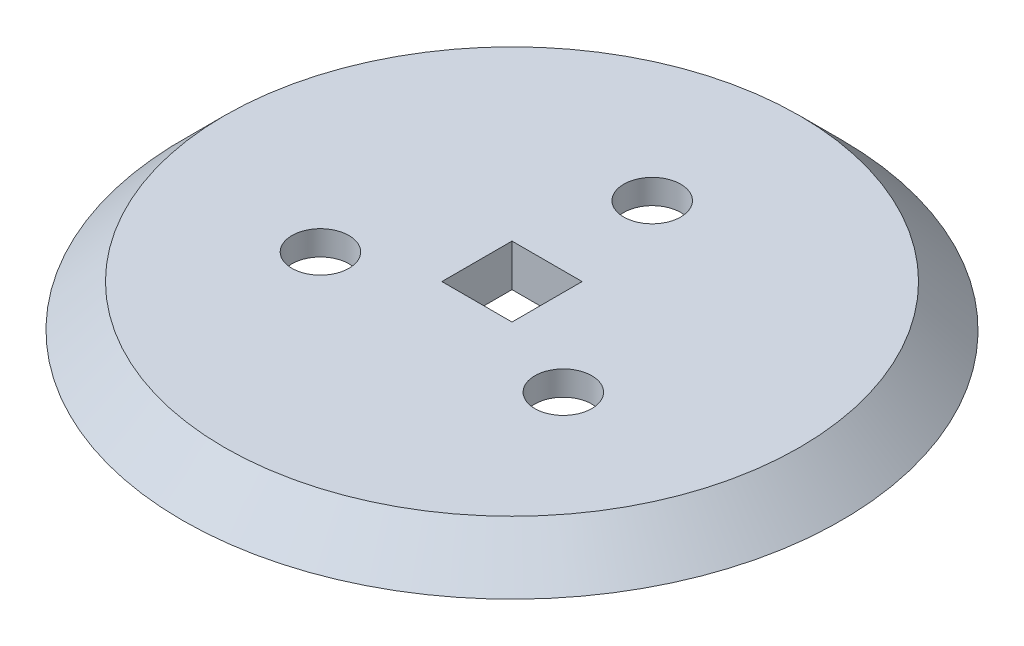
ISO-10303-21;
HEADER;
FILE_DESCRIPTION(('STEP AP214'),'2;1');
FILE_NAME('part.step','',(''),(''),'','','');
FILE_SCHEMA(('AUTOMOTIVE_DESIGN { 1 0 10303 214 1 1 1 1 }'));
ENDSEC;
DATA;
#1=APPLICATION_CONTEXT('core data for automotive mechanical design processes');
#2=APPLICATION_PROTOCOL_DEFINITION('international standard','automotive_design',2000,#1);
#3=PRODUCT_CONTEXT('',#1,'mechanical');
#4=PRODUCT('Part','Part','',(#3));
#5=PRODUCT_RELATED_PRODUCT_CATEGORY('part','',(#4));
#6=PRODUCT_DEFINITION_FORMATION('','',#4);
#7=PRODUCT_DEFINITION_CONTEXT('part definition',#1,'design');
#8=PRODUCT_DEFINITION('design','',#6,#7);
#9=PRODUCT_DEFINITION_SHAPE('','',#8);
#10=(LENGTH_UNIT() NAMED_UNIT(*) SI_UNIT(.MILLI.,.METRE.));
#11=(NAMED_UNIT(*) PLANE_ANGLE_UNIT() SI_UNIT($,.RADIAN.));
#12=(NAMED_UNIT(*) SI_UNIT($,.STERADIAN.) SOLID_ANGLE_UNIT());
#13=UNCERTAINTY_MEASURE_WITH_UNIT(LENGTH_MEASURE(1.E-05),#10,'distance_accuracy_value','');
#14=(GEOMETRIC_REPRESENTATION_CONTEXT(3) GLOBAL_UNCERTAINTY_ASSIGNED_CONTEXT((#13)) GLOBAL_UNIT_ASSIGNED_CONTEXT((#10,
#11,#12)) REPRESENTATION_CONTEXT('',''));
#15=CARTESIAN_POINT('',(0.,0.,0.));
#16=DIRECTION('',(0.,0.,1.));
#17=DIRECTION('',(1.,0.,0.));
#18=AXIS2_PLACEMENT_3D('',#15,#16,#17);
#19=CARTESIAN_POINT('',(0.,3.81,-12.7));
#20=DIRECTION('',(0.,-1.,0.));
#21=DIRECTION('',(0.,0.,-1.));
#22=AXIS2_PLACEMENT_3D('',#19,#20,#21);
#23=CYLINDRICAL_SURFACE('',#22,2.5796875);
#24=CARTESIAN_POINT('',(0.,3.81,-12.7));
#25=DIRECTION('',(0.,1.,0.));
#26=DIRECTION('',(0.,0.,1.));
#27=AXIS2_PLACEMENT_3D('',#24,#25,#26);
#28=CIRCLE('',#27,2.5796875);
#29=CARTESIAN_POINT('',(0.,3.81,-15.2796875));
#30=VERTEX_POINT('',#29);
#31=EDGE_CURVE('E105',#30,#30,#28,.T.);
#32=CARTESIAN_POINT('',(0.,1.5875,-12.7));
#33=DIRECTION('',(0.,-1.,0.));
#34=DIRECTION('',(0.,0.,-1.));
#35=AXIS2_PLACEMENT_3D('',#32,#33,#34);
#36=CIRCLE('',#35,2.5796875);
#37=CARTESIAN_POINT('',(0.,1.5875,-15.2796875));
#38=VERTEX_POINT('',#37);
#39=EDGE_CURVE('E37',#38,#38,#36,.T.);
#40=CARTESIAN_POINT('',(0.,3.81,-15.2796875));
#41=CARTESIAN_POINT('',(0.,3.78684895833333,-15.2796875));
#42=CARTESIAN_POINT('',(0.,3.76369791666667,-15.2796875));
#43=CARTESIAN_POINT('',(0.,3.71739583333333,-15.2796875));
#44=CARTESIAN_POINT('',(0.,3.69424479166667,-15.2796875));
#45=CARTESIAN_POINT('',(0.,3.64794270833333,-15.2796875));
#46=CARTESIAN_POINT('',(0.,3.62479166666667,-15.2796875));
#47=CARTESIAN_POINT('',(0.,3.57848958333333,-15.2796875));
#48=CARTESIAN_POINT('',(0.,3.55533854166667,-15.2796875));
#49=CARTESIAN_POINT('',(0.,3.50903645833333,-15.2796875));
#50=CARTESIAN_POINT('',(0.,3.48588541666667,-15.2796875));
#51=CARTESIAN_POINT('',(0.,3.43958333333333,-15.2796875));
#52=CARTESIAN_POINT('',(0.,3.41643229166667,-15.2796875));
#53=CARTESIAN_POINT('',(0.,3.37013020833333,-15.2796875));
#54=CARTESIAN_POINT('',(0.,3.34697916666667,-15.2796875));
#55=CARTESIAN_POINT('',(0.,3.30067708333333,-15.2796875));
#56=CARTESIAN_POINT('',(0.,3.27752604166667,-15.2796875));
#57=CARTESIAN_POINT('',(0.,3.23122395833333,-15.2796875));
#58=CARTESIAN_POINT('',(0.,3.20807291666667,-15.2796875));
#59=CARTESIAN_POINT('',(0.,3.16177083333333,-15.2796875));
#60=CARTESIAN_POINT('',(0.,3.13861979166667,-15.2796875));
#61=CARTESIAN_POINT('',(0.,3.09231770833333,-15.2796875));
#62=CARTESIAN_POINT('',(0.,3.06916666666667,-15.2796875));
#63=CARTESIAN_POINT('',(0.,3.02286458333333,-15.2796875));
#64=CARTESIAN_POINT('',(0.,2.99971354166667,-15.2796875));
#65=CARTESIAN_POINT('',(0.,2.95341145833333,-15.2796875));
#66=CARTESIAN_POINT('',(0.,2.93026041666667,-15.2796875));
#67=CARTESIAN_POINT('',(0.,2.88395833333333,-15.2796875));
#68=CARTESIAN_POINT('',(0.,2.86080729166667,-15.2796875));
#69=CARTESIAN_POINT('',(0.,2.81450520833333,-15.2796875));
#70=CARTESIAN_POINT('',(0.,2.79135416666667,-15.2796875));
#71=CARTESIAN_POINT('',(0.,2.74505208333333,-15.2796875));
#72=CARTESIAN_POINT('',(0.,2.72190104166667,-15.2796875));
#73=CARTESIAN_POINT('',(0.,2.67559895833333,-15.2796875));
#74=CARTESIAN_POINT('',(0.,2.65244791666667,-15.2796875));
#75=CARTESIAN_POINT('',(0.,2.60614583333333,-15.2796875));
#76=CARTESIAN_POINT('',(0.,2.58299479166667,-15.2796875));
#77=CARTESIAN_POINT('',(0.,2.53669270833333,-15.2796875));
#78=CARTESIAN_POINT('',(0.,2.51354166666667,-15.2796875));
#79=CARTESIAN_POINT('',(0.,2.46723958333333,-15.2796875));
#80=CARTESIAN_POINT('',(0.,2.44408854166667,-15.2796875));
#81=CARTESIAN_POINT('',(0.,2.39778645833333,-15.2796875));
#82=CARTESIAN_POINT('',(0.,2.37463541666667,-15.2796875));
#83=CARTESIAN_POINT('',(0.,2.32833333333333,-15.2796875));
#84=CARTESIAN_POINT('',(0.,2.30518229166667,-15.2796875));
#85=CARTESIAN_POINT('',(0.,2.25888020833333,-15.2796875));
#86=CARTESIAN_POINT('',(0.,2.23572916666667,-15.2796875));
#87=CARTESIAN_POINT('',(0.,2.18942708333333,-15.2796875));
#88=CARTESIAN_POINT('',(0.,2.16627604166667,-15.2796875));
#89=CARTESIAN_POINT('',(0.,2.11997395833333,-15.2796875));
#90=CARTESIAN_POINT('',(0.,2.09682291666667,-15.2796875));
#91=CARTESIAN_POINT('',(0.,2.05052083333333,-15.2796875));
#92=CARTESIAN_POINT('',(0.,2.02736979166667,-15.2796875));
#93=CARTESIAN_POINT('',(0.,1.98106770833333,-15.2796875));
#94=CARTESIAN_POINT('',(0.,1.95791666666667,-15.2796875));
#95=CARTESIAN_POINT('',(0.,1.91161458333333,-15.2796875));
#96=CARTESIAN_POINT('',(0.,1.88846354166667,-15.2796875));
#97=CARTESIAN_POINT('',(0.,1.84216145833333,-15.2796875));
#98=CARTESIAN_POINT('',(0.,1.81901041666667,-15.2796875));
#99=CARTESIAN_POINT('',(0.,1.77270833333333,-15.2796875));
#100=CARTESIAN_POINT('',(0.,1.74955729166667,-15.2796875));
#101=CARTESIAN_POINT('',(0.,1.70325520833333,-15.2796875));
#102=CARTESIAN_POINT('',(0.,1.68010416666667,-15.2796875));
#103=CARTESIAN_POINT('',(0.,1.63380208333333,-15.2796875));
#104=CARTESIAN_POINT('',(0.,1.61065104166667,-15.2796875));
#105=CARTESIAN_POINT('',(0.,1.5875,-15.2796875));
#106=B_SPLINE_CURVE_WITH_KNOTS('',3,(#40,#41,#42,#43,#44,#45,#46,#47,#48,#49,#50,#51,#52,#53,
#54,#55,#56,#57,#58,#59,#60,#61,#62,#63,#64,#65,#66,#67,#68,#69,#70,#71,#72,#73,#74,#75,#76,#77,
#78,#79,#80,#81,#82,#83,#84,#85,#86,#87,#88,#89,#90,#91,#92,#93,#94,#95,#96,#97,#98,#99,#100,
#101,#102,#103,#104,#105),.UNSPECIFIED.,.F.,.F.,(4,2,2,2,2,2,2,2,2,2,2,2,2,2,2,2,2,2,2,2,2,2,2,
2,2,2,2,2,2,2,2,2,4),(0.,0.0694531249999996,0.13890625,0.208359375,0.277812499999999,
0.347265624999999,0.41671875,0.486171875,0.555625,0.625078124999999,0.694531249999999,
0.763984374999999,0.833437499999999,0.902890625,0.972343749999999,1.041796875,1.11125,
1.180703125,1.25015625,1.319609375,1.3890625,1.458515625,1.52796875,1.597421875,1.666875,
1.736328125,1.80578125,1.875234375,1.9446875,2.014140625,2.08359375,2.153046875,2.2225),.UNSPECIFIED.);
#107=EDGE_CURVE('BSEAM33',#30,#38,#106,.T.);
#108=ORIENTED_EDGE('',*,*,#31,.T.);
#109=ORIENTED_EDGE('',*,*,#39,.T.);
#110=ORIENTED_EDGE('',*,*,#107,.T.);
#111=ORIENTED_EDGE('',*,*,#107,.F.);
#112=EDGE_LOOP('',(#108,#110,#109,#111));
#113=FACE_BOUND('',#112,.T.);
#114=ADVANCED_FACE('F33',(#113),#23,.F.);
#115=CARTESIAN_POINT('',(10.9985226280623,3.81,6.35000000000005));
#116=DIRECTION('',(0.,-1.,0.));
#117=DIRECTION('',(0.,0.,-1.));
#118=AXIS2_PLACEMENT_3D('',#115,#116,#117);
#119=CYLINDRICAL_SURFACE('',#118,2.5796875);
#120=CARTESIAN_POINT('',(10.9985226280623,3.81,6.35000000000005));
#121=DIRECTION('',(0.,1.,0.));
#122=DIRECTION('',(0.,0.,1.));
#123=AXIS2_PLACEMENT_3D('',#120,#121,#122);
#124=CIRCLE('',#123,2.5796875);
#125=CARTESIAN_POINT('',(10.9985226280623,3.81,3.77031250000005));
#126=VERTEX_POINT('',#125);
#127=EDGE_CURVE('E129',#126,#126,#124,.T.);
#128=CARTESIAN_POINT('',(10.9985226280623,1.5875,6.35000000000005));
#129=DIRECTION('',(0.,-1.,0.));
#130=DIRECTION('',(0.,0.,-1.));
#131=AXIS2_PLACEMENT_3D('',#128,#129,#130);
#132=CIRCLE('',#131,2.5796875);
#133=CARTESIAN_POINT('',(10.9985226280623,1.5875,3.77031250000005));
#134=VERTEX_POINT('',#133);
#135=EDGE_CURVE('E119',#134,#134,#132,.T.);
#136=CARTESIAN_POINT('',(10.9985226280623,3.81,3.77031250000005));
#137=CARTESIAN_POINT('',(10.9985226280623,3.78684895833333,3.77031250000005));
#138=CARTESIAN_POINT('',(10.9985226280623,3.76369791666667,3.77031250000005));
#139=CARTESIAN_POINT('',(10.9985226280623,3.71739583333333,3.77031250000005));
#140=CARTESIAN_POINT('',(10.9985226280623,3.69424479166667,3.77031250000005));
#141=CARTESIAN_POINT('',(10.9985226280623,3.64794270833333,3.77031250000005));
#142=CARTESIAN_POINT('',(10.9985226280623,3.62479166666667,3.77031250000005));
#143=CARTESIAN_POINT('',(10.9985226280623,3.57848958333333,3.77031250000005));
#144=CARTESIAN_POINT('',(10.9985226280623,3.55533854166667,3.77031250000005));
#145=CARTESIAN_POINT('',(10.9985226280623,3.50903645833333,3.77031250000005));
#146=CARTESIAN_POINT('',(10.9985226280623,3.48588541666667,3.77031250000005));
#147=CARTESIAN_POINT('',(10.9985226280623,3.43958333333333,3.77031250000005));
#148=CARTESIAN_POINT('',(10.9985226280623,3.41643229166667,3.77031250000005));
#149=CARTESIAN_POINT('',(10.9985226280623,3.37013020833333,3.77031250000005));
#150=CARTESIAN_POINT('',(10.9985226280623,3.34697916666667,3.77031250000005));
#151=CARTESIAN_POINT('',(10.9985226280623,3.30067708333333,3.77031250000005));
#152=CARTESIAN_POINT('',(10.9985226280623,3.27752604166667,3.77031250000005));
#153=CARTESIAN_POINT('',(10.9985226280623,3.23122395833333,3.77031250000005));
#154=CARTESIAN_POINT('',(10.9985226280623,3.20807291666667,3.77031250000005));
#155=CARTESIAN_POINT('',(10.9985226280623,3.16177083333333,3.77031250000005));
#156=CARTESIAN_POINT('',(10.9985226280623,3.13861979166667,3.77031250000005));
#157=CARTESIAN_POINT('',(10.9985226280623,3.09231770833333,3.77031250000005));
#158=CARTESIAN_POINT('',(10.9985226280623,3.06916666666667,3.77031250000005));
#159=CARTESIAN_POINT('',(10.9985226280623,3.02286458333333,3.77031250000005));
#160=CARTESIAN_POINT('',(10.9985226280623,2.99971354166667,3.77031250000005));
#161=CARTESIAN_POINT('',(10.9985226280623,2.95341145833333,3.77031250000005));
#162=CARTESIAN_POINT('',(10.9985226280623,2.93026041666667,3.77031250000005));
#163=CARTESIAN_POINT('',(10.9985226280623,2.88395833333333,3.77031250000005));
#164=CARTESIAN_POINT('',(10.9985226280623,2.86080729166667,3.77031250000005));
#165=CARTESIAN_POINT('',(10.9985226280623,2.81450520833333,3.77031250000005));
#166=CARTESIAN_POINT('',(10.9985226280623,2.79135416666667,3.77031250000005));
#167=CARTESIAN_POINT('',(10.9985226280623,2.74505208333333,3.77031250000005));
#168=CARTESIAN_POINT('',(10.9985226280623,2.72190104166667,3.77031250000005));
#169=CARTESIAN_POINT('',(10.9985226280623,2.67559895833333,3.77031250000005));
#170=CARTESIAN_POINT('',(10.9985226280623,2.65244791666667,3.77031250000005));
#171=CARTESIAN_POINT('',(10.9985226280623,2.60614583333333,3.77031250000005));
#172=CARTESIAN_POINT('',(10.9985226280623,2.58299479166667,3.77031250000005));
#173=CARTESIAN_POINT('',(10.9985226280623,2.53669270833333,3.77031250000005));
#174=CARTESIAN_POINT('',(10.9985226280623,2.51354166666667,3.77031250000005));
#175=CARTESIAN_POINT('',(10.9985226280623,2.46723958333333,3.77031250000005));
#176=CARTESIAN_POINT('',(10.9985226280623,2.44408854166667,3.77031250000005));
#177=CARTESIAN_POINT('',(10.9985226280623,2.39778645833333,3.77031250000005));
#178=CARTESIAN_POINT('',(10.9985226280623,2.37463541666667,3.77031250000005));
#179=CARTESIAN_POINT('',(10.9985226280623,2.32833333333333,3.77031250000005));
#180=CARTESIAN_POINT('',(10.9985226280623,2.30518229166667,3.77031250000005));
#181=CARTESIAN_POINT('',(10.9985226280623,2.25888020833333,3.77031250000005));
#182=CARTESIAN_POINT('',(10.9985226280623,2.23572916666667,3.77031250000005));
#183=CARTESIAN_POINT('',(10.9985226280623,2.18942708333333,3.77031250000005));
#184=CARTESIAN_POINT('',(10.9985226280623,2.16627604166667,3.77031250000005));
#185=CARTESIAN_POINT('',(10.9985226280623,2.11997395833333,3.77031250000005));
#186=CARTESIAN_POINT('',(10.9985226280623,2.09682291666667,3.77031250000005));
#187=CARTESIAN_POINT('',(10.9985226280623,2.05052083333333,3.77031250000005));
#188=CARTESIAN_POINT('',(10.9985226280623,2.02736979166667,3.77031250000005));
#189=CARTESIAN_POINT('',(10.9985226280623,1.98106770833333,3.77031250000005));
#190=CARTESIAN_POINT('',(10.9985226280623,1.95791666666667,3.77031250000005));
#191=CARTESIAN_POINT('',(10.9985226280623,1.91161458333333,3.77031250000005));
#192=CARTESIAN_POINT('',(10.9985226280623,1.88846354166667,3.77031250000005));
#193=CARTESIAN_POINT('',(10.9985226280623,1.84216145833333,3.77031250000005));
#194=CARTESIAN_POINT('',(10.9985226280623,1.81901041666667,3.77031250000005));
#195=CARTESIAN_POINT('',(10.9985226280623,1.77270833333333,3.77031250000005));
#196=CARTESIAN_POINT('',(10.9985226280623,1.74955729166667,3.77031250000005));
#197=CARTESIAN_POINT('',(10.9985226280623,1.70325520833333,3.77031250000005));
#198=CARTESIAN_POINT('',(10.9985226280623,1.68010416666667,3.77031250000005));
#199=CARTESIAN_POINT('',(10.9985226280623,1.63380208333333,3.77031250000005));
#200=CARTESIAN_POINT('',(10.9985226280623,1.61065104166667,3.77031250000005));
#201=CARTESIAN_POINT('',(10.9985226280623,1.5875,3.77031250000005));
#202=B_SPLINE_CURVE_WITH_KNOTS('',3,(#136,#137,#138,#139,#140,#141,#142,#143,#144,#145,#146,
#147,#148,#149,#150,#151,#152,#153,#154,#155,#156,#157,#158,#159,#160,#161,#162,#163,#164,#165,
#166,#167,#168,#169,#170,#171,#172,#173,#174,#175,#176,#177,#178,#179,#180,#181,#182,#183,#184,
#185,#186,#187,#188,#189,#190,#191,#192,#193,#194,#195,#196,#197,#198,#199,#200,#201),
.UNSPECIFIED.,.F.,.F.,(4,2,2,2,2,2,2,2,2,2,2,2,2,2,2,2,2,2,2,2,2,2,2,2,2,2,2,2,2,2,2,2,4),(0.,
0.0694531249999996,0.13890625,0.208359375,0.277812499999999,0.347265624999999,0.41671875,
0.486171875,0.555625,0.625078124999999,0.694531249999999,0.763984374999999,0.833437499999999,
0.902890625,0.972343749999999,1.041796875,1.11125,1.180703125,1.25015625,1.319609375,1.3890625,
1.458515625,1.52796875,1.597421875,1.666875,1.736328125,1.80578125,1.875234375,1.9446875,
2.014140625,2.08359375,2.153046875,2.2225),.UNSPECIFIED.);
#203=EDGE_CURVE('BSEAM152',#126,#134,#202,.T.);
#204=ORIENTED_EDGE('',*,*,#127,.T.);
#205=ORIENTED_EDGE('',*,*,#135,.T.);
#206=ORIENTED_EDGE('',*,*,#203,.T.);
#207=ORIENTED_EDGE('',*,*,#203,.F.);
#208=EDGE_LOOP('',(#204,#206,#205,#207));
#209=FACE_BOUND('',#208,.T.);
#210=ADVANCED_FACE('F152',(#209),#119,.F.);
#211=CARTESIAN_POINT('',(-10.9985226280624,3.81,6.3499999999999));
#212=DIRECTION('',(0.,-1.,0.));
#213=DIRECTION('',(0.,0.,-1.));
#214=AXIS2_PLACEMENT_3D('',#211,#212,#213);
#215=CYLINDRICAL_SURFACE('',#214,2.5796875);
#216=CARTESIAN_POINT('',(-10.9985226280624,3.81,6.3499999999999));
#217=DIRECTION('',(0.,1.,0.));
#218=DIRECTION('',(0.,0.,1.));
#219=AXIS2_PLACEMENT_3D('',#216,#217,#218);
#220=CIRCLE('',#219,2.5796875);
#221=CARTESIAN_POINT('',(-10.9985226280624,3.81,3.7703124999999));
#222=VERTEX_POINT('',#221);
#223=EDGE_CURVE('E125',#222,#222,#220,.T.);
#224=CARTESIAN_POINT('',(-10.9985226280624,1.5875,6.3499999999999));
#225=DIRECTION('',(0.,-1.,0.));
#226=DIRECTION('',(0.,0.,-1.));
#227=AXIS2_PLACEMENT_3D('',#224,#225,#226);
#228=CIRCLE('',#227,2.5796875);
#229=CARTESIAN_POINT('',(-10.9985226280624,1.5875,3.7703124999999));
#230=VERTEX_POINT('',#229);
#231=EDGE_CURVE('E117',#230,#230,#228,.T.);
#232=CARTESIAN_POINT('',(-10.9985226280624,3.81,3.7703124999999));
#233=CARTESIAN_POINT('',(-10.9985226280624,3.78684895833333,3.7703124999999));
#234=CARTESIAN_POINT('',(-10.9985226280624,3.76369791666667,3.7703124999999));
#235=CARTESIAN_POINT('',(-10.9985226280624,3.71739583333333,3.7703124999999));
#236=CARTESIAN_POINT('',(-10.9985226280624,3.69424479166667,3.7703124999999));
#237=CARTESIAN_POINT('',(-10.9985226280624,3.64794270833333,3.7703124999999));
#238=CARTESIAN_POINT('',(-10.9985226280624,3.62479166666667,3.7703124999999));
#239=CARTESIAN_POINT('',(-10.9985226280624,3.57848958333333,3.7703124999999));
#240=CARTESIAN_POINT('',(-10.9985226280624,3.55533854166667,3.7703124999999));
#241=CARTESIAN_POINT('',(-10.9985226280624,3.50903645833333,3.7703124999999));
#242=CARTESIAN_POINT('',(-10.9985226280624,3.48588541666667,3.7703124999999));
#243=CARTESIAN_POINT('',(-10.9985226280624,3.43958333333333,3.7703124999999));
#244=CARTESIAN_POINT('',(-10.9985226280624,3.41643229166667,3.7703124999999));
#245=CARTESIAN_POINT('',(-10.9985226280624,3.37013020833333,3.7703124999999));
#246=CARTESIAN_POINT('',(-10.9985226280624,3.34697916666667,3.7703124999999));
#247=CARTESIAN_POINT('',(-10.9985226280624,3.30067708333333,3.7703124999999));
#248=CARTESIAN_POINT('',(-10.9985226280624,3.27752604166667,3.7703124999999));
#249=CARTESIAN_POINT('',(-10.9985226280624,3.23122395833333,3.7703124999999));
#250=CARTESIAN_POINT('',(-10.9985226280624,3.20807291666667,3.7703124999999));
#251=CARTESIAN_POINT('',(-10.9985226280624,3.16177083333333,3.7703124999999));
#252=CARTESIAN_POINT('',(-10.9985226280624,3.13861979166667,3.7703124999999));
#253=CARTESIAN_POINT('',(-10.9985226280624,3.09231770833333,3.7703124999999));
#254=CARTESIAN_POINT('',(-10.9985226280624,3.06916666666667,3.7703124999999));
#255=CARTESIAN_POINT('',(-10.9985226280624,3.02286458333333,3.7703124999999));
#256=CARTESIAN_POINT('',(-10.9985226280624,2.99971354166667,3.7703124999999));
#257=CARTESIAN_POINT('',(-10.9985226280624,2.95341145833333,3.7703124999999));
#258=CARTESIAN_POINT('',(-10.9985226280624,2.93026041666667,3.7703124999999));
#259=CARTESIAN_POINT('',(-10.9985226280624,2.88395833333333,3.7703124999999));
#260=CARTESIAN_POINT('',(-10.9985226280624,2.86080729166667,3.7703124999999));
#261=CARTESIAN_POINT('',(-10.9985226280624,2.81450520833333,3.7703124999999));
#262=CARTESIAN_POINT('',(-10.9985226280624,2.79135416666667,3.7703124999999));
#263=CARTESIAN_POINT('',(-10.9985226280624,2.74505208333333,3.7703124999999));
#264=CARTESIAN_POINT('',(-10.9985226280624,2.72190104166667,3.7703124999999));
#265=CARTESIAN_POINT('',(-10.9985226280624,2.67559895833333,3.7703124999999));
#266=CARTESIAN_POINT('',(-10.9985226280624,2.65244791666667,3.7703124999999));
#267=CARTESIAN_POINT('',(-10.9985226280624,2.60614583333333,3.7703124999999));
#268=CARTESIAN_POINT('',(-10.9985226280624,2.58299479166667,3.7703124999999));
#269=CARTESIAN_POINT('',(-10.9985226280624,2.53669270833333,3.7703124999999));
#270=CARTESIAN_POINT('',(-10.9985226280624,2.51354166666667,3.7703124999999));
#271=CARTESIAN_POINT('',(-10.9985226280624,2.46723958333333,3.7703124999999));
#272=CARTESIAN_POINT('',(-10.9985226280624,2.44408854166667,3.7703124999999));
#273=CARTESIAN_POINT('',(-10.9985226280624,2.39778645833333,3.7703124999999));
#274=CARTESIAN_POINT('',(-10.9985226280624,2.37463541666667,3.7703124999999));
#275=CARTESIAN_POINT('',(-10.9985226280624,2.32833333333333,3.7703124999999));
#276=CARTESIAN_POINT('',(-10.9985226280624,2.30518229166667,3.7703124999999));
#277=CARTESIAN_POINT('',(-10.9985226280624,2.25888020833333,3.7703124999999));
#278=CARTESIAN_POINT('',(-10.9985226280624,2.23572916666667,3.7703124999999));
#279=CARTESIAN_POINT('',(-10.9985226280624,2.18942708333333,3.7703124999999));
#280=CARTESIAN_POINT('',(-10.9985226280624,2.16627604166667,3.7703124999999));
#281=CARTESIAN_POINT('',(-10.9985226280624,2.11997395833333,3.7703124999999));
#282=CARTESIAN_POINT('',(-10.9985226280624,2.09682291666667,3.7703124999999));
#283=CARTESIAN_POINT('',(-10.9985226280624,2.05052083333333,3.7703124999999));
#284=CARTESIAN_POINT('',(-10.9985226280624,2.02736979166667,3.7703124999999));
#285=CARTESIAN_POINT('',(-10.9985226280624,1.98106770833333,3.7703124999999));
#286=CARTESIAN_POINT('',(-10.9985226280624,1.95791666666667,3.7703124999999));
#287=CARTESIAN_POINT('',(-10.9985226280624,1.91161458333333,3.7703124999999));
#288=CARTESIAN_POINT('',(-10.9985226280624,1.88846354166667,3.7703124999999));
#289=CARTESIAN_POINT('',(-10.9985226280624,1.84216145833333,3.7703124999999));
#290=CARTESIAN_POINT('',(-10.9985226280624,1.81901041666667,3.7703124999999));
#291=CARTESIAN_POINT('',(-10.9985226280624,1.77270833333333,3.7703124999999));
#292=CARTESIAN_POINT('',(-10.9985226280624,1.74955729166667,3.7703124999999));
#293=CARTESIAN_POINT('',(-10.9985226280624,1.70325520833333,3.7703124999999));
#294=CARTESIAN_POINT('',(-10.9985226280624,1.68010416666667,3.7703124999999));
#295=CARTESIAN_POINT('',(-10.9985226280624,1.63380208333333,3.7703124999999));
#296=CARTESIAN_POINT('',(-10.9985226280624,1.61065104166667,3.7703124999999));
#297=CARTESIAN_POINT('',(-10.9985226280624,1.5875,3.7703124999999));
#298=B_SPLINE_CURVE_WITH_KNOTS('',3,(#232,#233,#234,#235,#236,#237,#238,#239,#240,#241,#242,
#243,#244,#245,#246,#247,#248,#249,#250,#251,#252,#253,#254,#255,#256,#257,#258,#259,#260,#261,
#262,#263,#264,#265,#266,#267,#268,#269,#270,#271,#272,#273,#274,#275,#276,#277,#278,#279,#280,
#281,#282,#283,#284,#285,#286,#287,#288,#289,#290,#291,#292,#293,#294,#295,#296,#297),
.UNSPECIFIED.,.F.,.F.,(4,2,2,2,2,2,2,2,2,2,2,2,2,2,2,2,2,2,2,2,2,2,2,2,2,2,2,2,2,2,2,2,4),(0.,
0.0694531249999996,0.13890625,0.208359375,0.277812499999999,0.347265624999999,0.41671875,
0.486171875,0.555625,0.625078124999999,0.694531249999999,0.763984374999999,0.833437499999999,
0.902890625,0.972343749999999,1.041796875,1.11125,1.180703125,1.25015625,1.319609375,1.3890625,
1.458515625,1.52796875,1.597421875,1.666875,1.736328125,1.80578125,1.875234375,1.9446875,
2.014140625,2.08359375,2.153046875,2.2225),.UNSPECIFIED.);
#299=EDGE_CURVE('BSEAM144',#222,#230,#298,.T.);
#300=ORIENTED_EDGE('',*,*,#223,.T.);
#301=ORIENTED_EDGE('',*,*,#231,.T.);
#302=ORIENTED_EDGE('',*,*,#299,.T.);
#303=ORIENTED_EDGE('',*,*,#299,.F.);
#304=EDGE_LOOP('',(#300,#302,#301,#303));
#305=FACE_BOUND('',#304,.T.);
#306=ADVANCED_FACE('F144',(#305),#215,.F.);
#307=CARTESIAN_POINT('',(0.,3.81,0.));
#308=DIRECTION('',(0.,1.,0.));
#309=DIRECTION('',(0.,0.,1.));
#310=AXIS2_PLACEMENT_3D('',#307,#308,#309);
#311=PLANE('',#310);
#312=CARTESIAN_POINT('',(0.,3.81,0.));
#313=DIRECTION('',(0.,1.,0.));
#314=DIRECTION('',(0.,0.,1.));
#315=AXIS2_PLACEMENT_3D('',#312,#313,#314);
#316=CIRCLE('',#315,26.0349999999999);
#317=CARTESIAN_POINT('',(0.,3.81,-26.0349999999999));
#318=VERTEX_POINT('',#317);
#319=EDGE_CURVE('E42',#318,#318,#316,.T.);
#320=ORIENTED_EDGE('',*,*,#319,.T.);
#321=EDGE_LOOP('',(#320));
#322=FACE_BOUND('',#321,.T.);
#323=ORIENTED_EDGE('',*,*,#127,.F.);
#324=EDGE_LOOP('',(#323));
#325=FACE_BOUND('',#324,.T.);
#326=DIRECTION('',(1.,0.,0.));
#327=VECTOR('',#326,1.);
#328=CARTESIAN_POINT('',(-3.175,3.81,3.175));
#329=LINE('',#328,#327);
#330=CARTESIAN_POINT('',(-3.175,3.81,3.175));
#331=VERTEX_POINT('',#330);
#332=CARTESIAN_POINT('',(3.175,3.81,3.175));
#333=VERTEX_POINT('',#332);
#334=EDGE_CURVE('E84',#331,#333,#329,.T.);
#335=ORIENTED_EDGE('',*,*,#334,.F.);
#336=DIRECTION('',(0.,0.,1.));
#337=VECTOR('',#336,1.);
#338=CARTESIAN_POINT('',(-3.175,3.81,-3.175));
#339=LINE('',#338,#337);
#340=CARTESIAN_POINT('',(-3.175,3.81,-3.175));
#341=VERTEX_POINT('',#340);
#342=EDGE_CURVE('E76',#341,#331,#339,.T.);
#343=ORIENTED_EDGE('',*,*,#342,.F.);
#344=DIRECTION('',(-1.,0.,0.));
#345=VECTOR('',#344,1.);
#346=CARTESIAN_POINT('',(-3.175,3.81,-3.175));
#347=LINE('',#346,#345);
#348=CARTESIAN_POINT('',(3.175,3.81,-3.175));
#349=VERTEX_POINT('',#348);
#350=EDGE_CURVE('E99',#349,#341,#347,.T.);
#351=ORIENTED_EDGE('',*,*,#350,.F.);
#352=DIRECTION('',(0.,0.,-1.));
#353=VECTOR('',#352,1.);
#354=CARTESIAN_POINT('',(3.175,3.81,-3.175));
#355=LINE('',#354,#353);
#356=EDGE_CURVE('E97',#333,#349,#355,.T.);
#357=ORIENTED_EDGE('',*,*,#356,.F.);
#358=EDGE_LOOP('',(#335,#343,#351,#357));
#359=FACE_BOUND('',#358,.T.);
#360=ORIENTED_EDGE('',*,*,#31,.F.);
#361=EDGE_LOOP('',(#360));
#362=FACE_BOUND('',#361,.T.);
#363=ORIENTED_EDGE('',*,*,#223,.F.);
#364=EDGE_LOOP('',(#363));
#365=FACE_BOUND('',#364,.T.);
#366=ADVANCED_FACE('F95',(#322,#325,#359,#362,#365),#311,.T.);
#367=CARTESIAN_POINT('',(0.,0.,0.));
#368=DIRECTION('',(0.,1.,0.));
#369=DIRECTION('',(0.,0.,1.));
#370=AXIS2_PLACEMENT_3D('',#367,#368,#369);
#371=PLANE('',#370);
#372=CARTESIAN_POINT('',(0.,0.,-12.7));
#373=DIRECTION('',(0.,-1.,0.));
#374=DIRECTION('',(0.,0.,-1.));
#375=AXIS2_PLACEMENT_3D('',#372,#373,#374);
#376=CIRCLE('',#375,5.409375008);
#377=CARTESIAN_POINT('',(0.,0.,-18.109375008));
#378=VERTEX_POINT('',#377);
#379=EDGE_CURVE('E294',#378,#378,#376,.T.);
#380=ORIENTED_EDGE('',*,*,#379,.F.);
#381=EDGE_LOOP('',(#380));
#382=FACE_BOUND('',#381,.T.);
#383=CARTESIAN_POINT('',(-10.9985226280624,0.,6.3499999999999));
#384=DIRECTION('',(0.,-1.,0.));
#385=DIRECTION('',(0.,0.,-1.));
#386=AXIS2_PLACEMENT_3D('',#383,#384,#385);
#387=CIRCLE('',#386,5.409375008);
#388=CARTESIAN_POINT('',(-10.9985226280624,0.,0.940624991999896));
#389=VERTEX_POINT('',#388);
#390=EDGE_CURVE('E302',#389,#389,#387,.T.);
#391=ORIENTED_EDGE('',*,*,#390,.F.);
#392=EDGE_LOOP('',(#391));
#393=FACE_BOUND('',#392,.T.);
#394=CARTESIAN_POINT('',(10.9985226280623,0.,6.35000000000005));
#395=DIRECTION('',(0.,-1.,0.));
#396=DIRECTION('',(0.,0.,-1.));
#397=AXIS2_PLACEMENT_3D('',#394,#395,#396);
#398=CIRCLE('',#397,5.409375008);
#399=CARTESIAN_POINT('',(10.9985226280623,0.,0.940624992000051));
#400=VERTEX_POINT('',#399);
#401=EDGE_CURVE('E136',#400,#400,#398,.T.);
#402=ORIENTED_EDGE('',*,*,#401,.F.);
#403=EDGE_LOOP('',(#402));
#404=FACE_BOUND('',#403,.T.);
#405=CARTESIAN_POINT('',(0.,0.,0.));
#406=DIRECTION('',(0.,1.,0.));
#407=DIRECTION('',(0.,0.,1.));
#408=AXIS2_PLACEMENT_3D('',#405,#406,#407);
#409=CIRCLE('',#408,29.8449999999999);
#410=CARTESIAN_POINT('',(0.,0.,-29.8449999999999));
#411=VERTEX_POINT('',#410);
#412=EDGE_CURVE('E11',#411,#411,#409,.F.);
#413=ORIENTED_EDGE('',*,*,#412,.T.);
#414=EDGE_LOOP('',(#413));
#415=FACE_BOUND('',#414,.T.);
#416=DIRECTION('',(0.,0.,1.));
#417=VECTOR('',#416,1.);
#418=CARTESIAN_POINT('',(-3.175,0.,-3.175));
#419=LINE('',#418,#417);
#420=CARTESIAN_POINT('',(-3.175,0.,-3.175));
#421=VERTEX_POINT('',#420);
#422=CARTESIAN_POINT('',(-3.175,0.,3.175));
#423=VERTEX_POINT('',#422);
#424=EDGE_CURVE('E58',#421,#423,#419,.T.);
#425=ORIENTED_EDGE('',*,*,#424,.T.);
#426=DIRECTION('',(1.,0.,0.));
#427=VECTOR('',#426,1.);
#428=CARTESIAN_POINT('',(-3.175,0.,3.175));
#429=LINE('',#428,#427);
#430=CARTESIAN_POINT('',(3.175,0.,3.175));
#431=VERTEX_POINT('',#430);
#432=EDGE_CURVE('E91',#423,#431,#429,.T.);
#433=ORIENTED_EDGE('',*,*,#432,.T.);
#434=DIRECTION('',(0.,0.,-1.));
#435=VECTOR('',#434,1.);
#436=CARTESIAN_POINT('',(3.175,0.,-3.175));
#437=LINE('',#436,#435);
#438=CARTESIAN_POINT('',(3.175,0.,-3.175));
#439=VERTEX_POINT('',#438);
#440=EDGE_CURVE('E107',#431,#439,#437,.T.);
#441=ORIENTED_EDGE('',*,*,#440,.T.);
#442=DIRECTION('',(-1.,0.,0.));
#443=VECTOR('',#442,1.);
#444=CARTESIAN_POINT('',(-3.175,0.,-3.175));
#445=LINE('',#444,#443);
#446=EDGE_CURVE('E85',#439,#421,#445,.T.);
#447=ORIENTED_EDGE('',*,*,#446,.T.);
#448=EDGE_LOOP('',(#425,#433,#441,#447));
#449=FACE_BOUND('',#448,.T.);
#450=ADVANCED_FACE('F143',(#382,#393,#404,#415,#449),#371,.F.);
#451=CARTESIAN_POINT('',(-3.175,3.81,-3.175));
#452=DIRECTION('',(1.,0.,0.));
#453=DIRECTION('',(0.,0.,-1.));
#454=AXIS2_PLACEMENT_3D('',#451,#452,#453);
#455=PLANE('',#454);
#456=ORIENTED_EDGE('',*,*,#424,.F.);
#457=DIRECTION('',(0.,-1.,0.));
#458=VECTOR('',#457,1.);
#459=CARTESIAN_POINT('',(-3.175,3.81,-3.175));
#460=LINE('',#459,#458);
#461=EDGE_CURVE('E80',#341,#421,#460,.T.);
#462=ORIENTED_EDGE('',*,*,#461,.F.);
#463=ORIENTED_EDGE('',*,*,#342,.T.);
#464=DIRECTION('',(0.,-1.,0.));
#465=VECTOR('',#464,1.);
#466=CARTESIAN_POINT('',(-3.175,3.81,3.175));
#467=LINE('',#466,#465);
#468=EDGE_CURVE('E79',#331,#423,#467,.T.);
#469=ORIENTED_EDGE('',*,*,#468,.T.);
#470=EDGE_LOOP('',(#456,#462,#463,#469));
#471=FACE_BOUND('',#470,.T.);
#472=ADVANCED_FACE('F78',(#471),#455,.T.);
#473=CARTESIAN_POINT('',(-3.175,3.81,3.175));
#474=DIRECTION('',(0.,0.,-1.));
#475=DIRECTION('',(-1.,0.,0.));
#476=AXIS2_PLACEMENT_3D('',#473,#474,#475);
#477=PLANE('',#476);
#478=ORIENTED_EDGE('',*,*,#432,.F.);
#479=ORIENTED_EDGE('',*,*,#468,.F.);
#480=ORIENTED_EDGE('',*,*,#334,.T.);
#481=DIRECTION('',(0.,-1.,0.));
#482=VECTOR('',#481,1.);
#483=CARTESIAN_POINT('',(3.175,3.81,3.175));
#484=LINE('',#483,#482);
#485=EDGE_CURVE('E92',#333,#431,#484,.T.);
#486=ORIENTED_EDGE('',*,*,#485,.T.);
#487=EDGE_LOOP('',(#478,#479,#480,#486));
#488=FACE_BOUND('',#487,.T.);
#489=ADVANCED_FACE('F88',(#488),#477,.T.);
#490=CARTESIAN_POINT('',(3.175,3.81,-3.175));
#491=DIRECTION('',(-1.,0.,0.));
#492=DIRECTION('',(0.,0.,1.));
#493=AXIS2_PLACEMENT_3D('',#490,#491,#492);
#494=PLANE('',#493);
#495=ORIENTED_EDGE('',*,*,#440,.F.);
#496=ORIENTED_EDGE('',*,*,#485,.F.);
#497=ORIENTED_EDGE('',*,*,#356,.T.);
#498=DIRECTION('',(0.,-1.,0.));
#499=VECTOR('',#498,1.);
#500=CARTESIAN_POINT('',(3.175,3.81,-3.175));
#501=LINE('',#500,#499);
#502=EDGE_CURVE('E50',#349,#439,#501,.T.);
#503=ORIENTED_EDGE('',*,*,#502,.T.);
#504=EDGE_LOOP('',(#495,#496,#497,#503));
#505=FACE_BOUND('',#504,.T.);
#506=ADVANCED_FACE('F167',(#505),#494,.T.);
#507=CARTESIAN_POINT('',(-3.175,3.81,-3.175));
#508=DIRECTION('',(0.,0.,1.));
#509=DIRECTION('',(1.,0.,0.));
#510=AXIS2_PLACEMENT_3D('',#507,#508,#509);
#511=PLANE('',#510);
#512=ORIENTED_EDGE('',*,*,#446,.F.);
#513=ORIENTED_EDGE('',*,*,#502,.F.);
#514=ORIENTED_EDGE('',*,*,#350,.T.);
#515=ORIENTED_EDGE('',*,*,#461,.T.);
#516=EDGE_LOOP('',(#512,#513,#514,#515));
#517=FACE_BOUND('',#516,.T.);
#518=ADVANCED_FACE('F164',(#517),#511,.T.);
#519=CARTESIAN_POINT('',(0.,3.81,0.));
#520=DIRECTION('',(0.,-1.,0.));
#521=DIRECTION('',(0.,0.,-1.));
#522=AXIS2_PLACEMENT_3D('',#519,#520,#521);
#523=CONICAL_SURFACE('',#522,26.0349999999999,0.785398163397454);
#524=CARTESIAN_POINT('',(0.,0.,-29.8449999999999));
#525=CARTESIAN_POINT('',(0.,0.0396875000000003,-29.8053124999999));
#526=CARTESIAN_POINT('',(0.,0.079375,-29.7656249999999));
#527=CARTESIAN_POINT('',(0.,0.15875,-29.6862499999999));
#528=CARTESIAN_POINT('',(0.,0.1984375,-29.6465624999999));
#529=CARTESIAN_POINT('',(0.,0.2778125,-29.5671874999999));
#530=CARTESIAN_POINT('',(0.,0.3175,-29.5274999999999));
#531=CARTESIAN_POINT('',(0.,0.396875,-29.4481249999999));
#532=CARTESIAN_POINT('',(0.,0.4365625,-29.4084374999999));
#533=CARTESIAN_POINT('',(0.,0.5159375,-29.3290624999999));
#534=CARTESIAN_POINT('',(0.,0.555625,-29.2893749999999));
#535=CARTESIAN_POINT('',(0.,0.635,-29.2099999999999));
#536=CARTESIAN_POINT('',(0.,0.6746875,-29.1703124999999));
#537=CARTESIAN_POINT('',(0.,0.7540625,-29.0909374999999));
#538=CARTESIAN_POINT('',(0.,0.79375,-29.0512499999999));
#539=CARTESIAN_POINT('',(0.,0.873125,-28.9718749999999));
#540=CARTESIAN_POINT('',(0.,0.9128125,-28.9321874999999));
#541=CARTESIAN_POINT('',(0.,0.9921875,-28.8528124999999));
#542=CARTESIAN_POINT('',(0.,1.031875,-28.8131249999999));
#543=CARTESIAN_POINT('',(0.,1.11125,-28.7337499999999));
#544=CARTESIAN_POINT('',(0.,1.1509375,-28.6940624999999));
#545=CARTESIAN_POINT('',(0.,1.2303125,-28.6146874999999));
#546=CARTESIAN_POINT('',(0.,1.27,-28.5749999999999));
#547=CARTESIAN_POINT('',(0.,1.349375,-28.4956249999999));
#548=CARTESIAN_POINT('',(0.,1.3890625,-28.4559374999999));
#549=CARTESIAN_POINT('',(0.,1.4684375,-28.3765624999999));
#550=CARTESIAN_POINT('',(0.,1.508125,-28.3368749999999));
#551=CARTESIAN_POINT('',(0.,1.5875,-28.2574999999999));
#552=CARTESIAN_POINT('',(0.,1.6271875,-28.2178124999999));
#553=CARTESIAN_POINT('',(0.,1.7065625,-28.1384374999999));
#554=CARTESIAN_POINT('',(0.,1.74625,-28.0987499999999));
#555=CARTESIAN_POINT('',(0.,1.825625,-28.0193749999999));
#556=CARTESIAN_POINT('',(0.,1.8653125,-27.9796874999999));
#557=CARTESIAN_POINT('',(0.,1.9446875,-27.9003124999999));
#558=CARTESIAN_POINT('',(0.,1.984375,-27.8606249999999));
#559=CARTESIAN_POINT('',(0.,2.06375,-27.7812499999999));
#560=CARTESIAN_POINT('',(0.,2.1034375,-27.7415624999999));
#561=CARTESIAN_POINT('',(0.,2.1828125,-27.6621874999999));
#562=CARTESIAN_POINT('',(0.,2.2225,-27.6224999999999));
#563=CARTESIAN_POINT('',(0.,2.301875,-27.5431249999999));
#564=CARTESIAN_POINT('',(0.,2.3415625,-27.5034374999999));
#565=CARTESIAN_POINT('',(0.,2.4209375,-27.4240624999999));
#566=CARTESIAN_POINT('',(0.,2.460625,-27.3843749999999));
#567=CARTESIAN_POINT('',(0.,2.54,-27.3049999999999));
#568=CARTESIAN_POINT('',(0.,2.5796875,-27.2653124999999));
#569=CARTESIAN_POINT('',(0.,2.6590625,-27.1859374999999));
#570=CARTESIAN_POINT('',(0.,2.69875,-27.1462499999999));
#571=CARTESIAN_POINT('',(0.,2.778125,-27.0668749999999));
#572=CARTESIAN_POINT('',(0.,2.8178125,-27.0271874999999));
#573=CARTESIAN_POINT('',(0.,2.8971875,-26.9478124999999));
#574=CARTESIAN_POINT('',(0.,2.936875,-26.9081249999999));
#575=CARTESIAN_POINT('',(0.,3.01625,-26.8287499999999));
#576=CARTESIAN_POINT('',(0.,3.0559375,-26.7890624999999));
#577=CARTESIAN_POINT('',(0.,3.1353125,-26.7096874999999));
#578=CARTESIAN_POINT('',(0.,3.175,-26.6699999999999));
#579=CARTESIAN_POINT('',(0.,3.254375,-26.5906249999999));
#580=CARTESIAN_POINT('',(0.,3.2940625,-26.5509374999999));
#581=CARTESIAN_POINT('',(0.,3.3734375,-26.4715624999999));
#582=CARTESIAN_POINT('',(0.,3.413125,-26.4318749999999));
#583=CARTESIAN_POINT('',(0.,3.4925,-26.3524999999999));
#584=CARTESIAN_POINT('',(0.,3.5321875,-26.3128124999999));
#585=CARTESIAN_POINT('',(0.,3.6115625,-26.2334374999999));
#586=CARTESIAN_POINT('',(0.,3.65125,-26.1937499999999));
#587=CARTESIAN_POINT('',(0.,3.730625,-26.1143749999999));
#588=CARTESIAN_POINT('',(0.,3.7703125,-26.0746874999999));
#589=CARTESIAN_POINT('',(0.,3.81,-26.0349999999999));
#590=B_SPLINE_CURVE_WITH_KNOTS('',3,(#524,#525,#526,#527,#528,#529,#530,#531,#532,#533,#534,
#535,#536,#537,#538,#539,#540,#541,#542,#543,#544,#545,#546,#547,#548,#549,#550,#551,#552,#553,
#554,#555,#556,#557,#558,#559,#560,#561,#562,#563,#564,#565,#566,#567,#568,#569,#570,#571,#572,
#573,#574,#575,#576,#577,#578,#579,#580,#581,#582,#583,#584,#585,#586,#587,#588,#589),
.UNSPECIFIED.,.F.,.F.,(4,2,2,2,2,2,2,2,2,2,2,2,2,2,2,2,2,2,2,2,2,2,2,2,2,2,2,2,2,2,2,2,4),(0.,
0.168379802270049,0.336759604540097,0.505139406810143,0.673519209080192,0.841899011350238,
1.01027881362029,1.17865861589033,1.34703841816038,1.51541822043043,1.68379802270048,
1.85217782497053,2.02055762724057,2.18893742951062,2.35731723178067,2.52569703405071,
2.69407683632076,2.86245663859081,3.03083644086086,3.1992162431309,3.36759604540095,
3.535975847671,3.70435564994105,3.87273545221109,4.04111525448114,4.20949505675119,
4.37787485902124,4.54625466129128,4.71463446356133,4.88301426583138,5.05139406810143,
5.21977387037148,5.38815367264152),.UNSPECIFIED.);
#591=EDGE_CURVE('BSEAM35',#411,#318,#590,.T.);
#592=ORIENTED_EDGE('',*,*,#412,.F.);
#593=ORIENTED_EDGE('',*,*,#319,.F.);
#594=ORIENTED_EDGE('',*,*,#591,.T.);
#595=ORIENTED_EDGE('',*,*,#591,.F.);
#596=EDGE_LOOP('',(#592,#594,#593,#595));
#597=FACE_BOUND('',#596,.T.);
#598=ADVANCED_FACE('F35',(#597),#523,.T.);
#599=CARTESIAN_POINT('',(-10.9985226280624,1.5875,6.3499999999999));
#600=DIRECTION('',(0.,-1.,0.));
#601=DIRECTION('',(0.,0.,-1.));
#602=AXIS2_PLACEMENT_3D('',#599,#600,#601);
#603=CYLINDRICAL_SURFACE('',#602,5.409375008);
#604=CARTESIAN_POINT('',(-10.9985226280624,1.5875,6.3499999999999));
#605=DIRECTION('',(0.,-1.,0.));
#606=DIRECTION('',(0.,0.,-1.));
#607=AXIS2_PLACEMENT_3D('',#604,#605,#606);
#608=CIRCLE('',#607,5.409375008);
#609=CARTESIAN_POINT('',(-10.9985226280624,1.5875,0.940624991999896));
#610=VERTEX_POINT('',#609);
#611=EDGE_CURVE('E297',#610,#610,#608,.T.);
#612=ORIENTED_EDGE('',*,*,#611,.F.);
#613=EDGE_LOOP('',(#612));
#614=FACE_BOUND('',#613,.T.);
#615=ORIENTED_EDGE('',*,*,#390,.T.);
#616=EDGE_LOOP('',(#615));
#617=FACE_BOUND('',#616,.T.);
#618=ADVANCED_FACE('F195',(#614,#617),#603,.F.);
#619=CARTESIAN_POINT('',(-10.9985226280624,1.5875,6.3499999999999));
#620=DIRECTION('',(0.,-1.,0.));
#621=DIRECTION('',(0.,0.,-1.));
#622=AXIS2_PLACEMENT_3D('',#619,#620,#621);
#623=PLANE('',#622);
#624=ORIENTED_EDGE('',*,*,#231,.F.);
#625=EDGE_LOOP('',(#624));
#626=FACE_BOUND('',#625,.T.);
#627=ORIENTED_EDGE('',*,*,#611,.T.);
#628=EDGE_LOOP('',(#627));
#629=FACE_BOUND('',#628,.T.);
#630=ADVANCED_FACE('F202',(#626,#629),#623,.T.);
#631=CARTESIAN_POINT('',(10.9985226280623,1.5875,6.35000000000005));
#632=DIRECTION('',(0.,-1.,0.));
#633=DIRECTION('',(0.,0.,-1.));
#634=AXIS2_PLACEMENT_3D('',#631,#632,#633);
#635=CYLINDRICAL_SURFACE('',#634,5.409375008);
#636=CARTESIAN_POINT('',(10.9985226280623,1.5875,6.35000000000005));
#637=DIRECTION('',(0.,-1.,0.));
#638=DIRECTION('',(0.,0.,-1.));
#639=AXIS2_PLACEMENT_3D('',#636,#637,#638);
#640=CIRCLE('',#639,5.409375008);
#641=CARTESIAN_POINT('',(10.9985226280623,1.5875,0.940624992000051));
#642=VERTEX_POINT('',#641);
#643=EDGE_CURVE('E304',#642,#642,#640,.T.);
#644=ORIENTED_EDGE('',*,*,#643,.F.);
#645=EDGE_LOOP('',(#644));
#646=FACE_BOUND('',#645,.T.);
#647=ORIENTED_EDGE('',*,*,#401,.T.);
#648=EDGE_LOOP('',(#647));
#649=FACE_BOUND('',#648,.T.);
#650=ADVANCED_FACE('F210',(#646,#649),#635,.F.);
#651=CARTESIAN_POINT('',(10.9985226280623,1.5875,6.35000000000005));
#652=DIRECTION('',(0.,-1.,0.));
#653=DIRECTION('',(0.,0.,-1.));
#654=AXIS2_PLACEMENT_3D('',#651,#652,#653);
#655=PLANE('',#654);
#656=ORIENTED_EDGE('',*,*,#135,.F.);
#657=EDGE_LOOP('',(#656));
#658=FACE_BOUND('',#657,.T.);
#659=ORIENTED_EDGE('',*,*,#643,.T.);
#660=EDGE_LOOP('',(#659));
#661=FACE_BOUND('',#660,.T.);
#662=ADVANCED_FACE('F218',(#658,#661),#655,.T.);
#663=CARTESIAN_POINT('',(0.,1.5875,-12.7));
#664=DIRECTION('',(0.,-1.,0.));
#665=DIRECTION('',(0.,0.,-1.));
#666=AXIS2_PLACEMENT_3D('',#663,#664,#665);
#667=CYLINDRICAL_SURFACE('',#666,5.409375008);
#668=CARTESIAN_POINT('',(0.,1.5875,-12.7));
#669=DIRECTION('',(0.,-1.,0.));
#670=DIRECTION('',(0.,0.,-1.));
#671=AXIS2_PLACEMENT_3D('',#668,#669,#670);
#672=CIRCLE('',#671,5.409375008);
#673=CARTESIAN_POINT('',(0.,1.5875,-18.109375008));
#674=VERTEX_POINT('',#673);
#675=EDGE_CURVE('E120',#674,#674,#672,.T.);
#676=ORIENTED_EDGE('',*,*,#675,.F.);
#677=EDGE_LOOP('',(#676));
#678=FACE_BOUND('',#677,.T.);
#679=ORIENTED_EDGE('',*,*,#379,.T.);
#680=EDGE_LOOP('',(#679));
#681=FACE_BOUND('',#680,.T.);
#682=ADVANCED_FACE('F226',(#678,#681),#667,.F.);
#683=CARTESIAN_POINT('',(0.,1.5875,-12.7));
#684=DIRECTION('',(0.,-1.,0.));
#685=DIRECTION('',(0.,0.,-1.));
#686=AXIS2_PLACEMENT_3D('',#683,#684,#685);
#687=PLANE('',#686);
#688=ORIENTED_EDGE('',*,*,#39,.F.);
#689=EDGE_LOOP('',(#688));
#690=FACE_BOUND('',#689,.T.);
#691=ORIENTED_EDGE('',*,*,#675,.T.);
#692=EDGE_LOOP('',(#691));
#693=FACE_BOUND('',#692,.T.);
#694=ADVANCED_FACE('F234',(#690,#693),#687,.T.);
#695=CLOSED_SHELL('',(#114,#210,#306,#366,#450,#472,#489,#506,#518,#598,#618,#630,#650,#662,
#682,#694));
#696=MANIFOLD_SOLID_BREP('B2',#695);
#697=ADVANCED_BREP_SHAPE_REPRESENTATION('',(#18,#696),#14);
#698=SHAPE_DEFINITION_REPRESENTATION(#9,#697);
ENDSEC;
END-ISO-10303-21;
